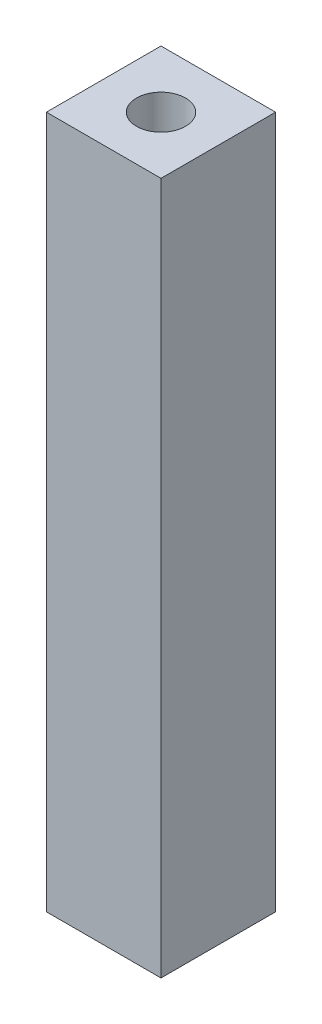
ISO-10303-21;
HEADER;
FILE_DESCRIPTION(('STEP AP214'),'2;1');
FILE_NAME('part.step','',(''),(''),'','','');
FILE_SCHEMA(('AUTOMOTIVE_DESIGN { 1 0 10303 214 1 1 1 1 }'));
ENDSEC;
DATA;
#1=APPLICATION_CONTEXT('core data for automotive mechanical design processes');
#2=APPLICATION_PROTOCOL_DEFINITION('international standard','automotive_design',2000,#1);
#3=PRODUCT_CONTEXT('',#1,'mechanical');
#4=PRODUCT('Part','Part','',(#3));
#5=PRODUCT_RELATED_PRODUCT_CATEGORY('part','',(#4));
#6=PRODUCT_DEFINITION_FORMATION('','',#4);
#7=PRODUCT_DEFINITION_CONTEXT('part definition',#1,'design');
#8=PRODUCT_DEFINITION('design','',#6,#7);
#9=PRODUCT_DEFINITION_SHAPE('','',#8);
#10=(LENGTH_UNIT() NAMED_UNIT(*) SI_UNIT(.MILLI.,.METRE.));
#11=(NAMED_UNIT(*) PLANE_ANGLE_UNIT() SI_UNIT($,.RADIAN.));
#12=(NAMED_UNIT(*) SI_UNIT($,.STERADIAN.) SOLID_ANGLE_UNIT());
#13=UNCERTAINTY_MEASURE_WITH_UNIT(LENGTH_MEASURE(1.E-05),#10,'distance_accuracy_value','');
#14=(GEOMETRIC_REPRESENTATION_CONTEXT(3) GLOBAL_UNCERTAINTY_ASSIGNED_CONTEXT((#13)) GLOBAL_UNIT_ASSIGNED_CONTEXT((#10,
#11,#12)) REPRESENTATION_CONTEXT('',''));
#15=CARTESIAN_POINT('',(0.,0.,0.));
#16=DIRECTION('',(0.,0.,1.));
#17=DIRECTION('',(1.,0.,0.));
#18=AXIS2_PLACEMENT_3D('',#15,#16,#17);
#19=CARTESIAN_POINT('',(0.,55.,0.));
#20=DIRECTION('',(1.,0.,0.));
#21=DIRECTION('',(0.,0.,-1.));
#22=AXIS2_PLACEMENT_3D('',#19,#20,#21);
#23=PLANE('',#22);
#24=DIRECTION('',(0.,0.,1.));
#25=VECTOR('',#24,1.);
#26=CARTESIAN_POINT('',(0.,0.,0.));
#27=LINE('',#26,#25);
#28=CARTESIAN_POINT('',(0.,0.,-9.1));
#29=VERTEX_POINT('',#28);
#30=CARTESIAN_POINT('',(0.,0.,0.));
#31=VERTEX_POINT('',#30);
#32=EDGE_CURVE('E107',#29,#31,#27,.T.);
#33=ORIENTED_EDGE('',*,*,#32,.T.);
#34=DIRECTION('',(0.,-1.,0.));
#35=VECTOR('',#34,1.);
#36=CARTESIAN_POINT('',(0.,55.,0.));
#37=LINE('',#36,#35);
#38=CARTESIAN_POINT('',(0.,55.,0.));
#39=VERTEX_POINT('',#38);
#40=EDGE_CURVE('E13',#39,#31,#37,.T.);
#41=ORIENTED_EDGE('',*,*,#40,.F.);
#42=DIRECTION('',(0.,0.,1.));
#43=VECTOR('',#42,1.);
#44=CARTESIAN_POINT('',(0.,55.,0.));
#45=LINE('',#44,#43);
#46=CARTESIAN_POINT('',(0.,55.,-9.1));
#47=VERTEX_POINT('',#46);
#48=EDGE_CURVE('E95',#47,#39,#45,.T.);
#49=ORIENTED_EDGE('',*,*,#48,.F.);
#50=DIRECTION('',(0.,-1.,0.));
#51=VECTOR('',#50,1.);
#52=CARTESIAN_POINT('',(0.,55.,-9.1));
#53=LINE('',#52,#51);
#54=EDGE_CURVE('E103',#47,#29,#53,.T.);
#55=ORIENTED_EDGE('',*,*,#54,.T.);
#56=EDGE_LOOP('',(#33,#41,#49,#55));
#57=FACE_BOUND('',#56,.T.);
#58=ADVANCED_FACE('F44',(#57),#23,.F.);
#59=CARTESIAN_POINT('',(0.,55.,0.));
#60=DIRECTION('',(0.,0.,-1.));
#61=DIRECTION('',(-1.,0.,0.));
#62=AXIS2_PLACEMENT_3D('',#59,#60,#61);
#63=PLANE('',#62);
#64=DIRECTION('',(1.,0.,0.));
#65=VECTOR('',#64,1.);
#66=CARTESIAN_POINT('',(0.,0.,0.));
#67=LINE('',#66,#65);
#68=CARTESIAN_POINT('',(9.1,0.,0.));
#69=VERTEX_POINT('',#68);
#70=EDGE_CURVE('E99',#31,#69,#67,.T.);
#71=ORIENTED_EDGE('',*,*,#70,.T.);
#72=DIRECTION('',(0.,-1.,0.));
#73=VECTOR('',#72,1.);
#74=CARTESIAN_POINT('',(9.1,55.,0.));
#75=LINE('',#74,#73);
#76=CARTESIAN_POINT('',(9.1,55.,0.));
#77=VERTEX_POINT('',#76);
#78=EDGE_CURVE('E52',#77,#69,#75,.T.);
#79=ORIENTED_EDGE('',*,*,#78,.F.);
#80=DIRECTION('',(1.,0.,0.));
#81=VECTOR('',#80,1.);
#82=CARTESIAN_POINT('',(0.,55.,0.));
#83=LINE('',#82,#81);
#84=EDGE_CURVE('E90',#39,#77,#83,.T.);
#85=ORIENTED_EDGE('',*,*,#84,.F.);
#86=ORIENTED_EDGE('',*,*,#40,.T.);
#87=EDGE_LOOP('',(#71,#79,#85,#86));
#88=FACE_BOUND('',#87,.T.);
#89=ADVANCED_FACE('F98',(#88),#63,.F.);
#90=CARTESIAN_POINT('',(9.1,55.,0.));
#91=DIRECTION('',(-1.,0.,0.));
#92=DIRECTION('',(0.,0.,1.));
#93=AXIS2_PLACEMENT_3D('',#90,#91,#92);
#94=PLANE('',#93);
#95=DIRECTION('',(0.,0.,-1.));
#96=VECTOR('',#95,1.);
#97=CARTESIAN_POINT('',(9.1,0.,0.));
#98=LINE('',#97,#96);
#99=CARTESIAN_POINT('',(9.1,0.,-9.1));
#100=VERTEX_POINT('',#99);
#101=EDGE_CURVE('E77',#69,#100,#98,.T.);
#102=ORIENTED_EDGE('',*,*,#101,.T.);
#103=DIRECTION('',(0.,-1.,0.));
#104=VECTOR('',#103,1.);
#105=CARTESIAN_POINT('',(9.1,55.,-9.1));
#106=LINE('',#105,#104);
#107=CARTESIAN_POINT('',(9.1,55.,-9.1));
#108=VERTEX_POINT('',#107);
#109=EDGE_CURVE('E100',#108,#100,#106,.T.);
#110=ORIENTED_EDGE('',*,*,#109,.F.);
#111=DIRECTION('',(0.,0.,-1.));
#112=VECTOR('',#111,1.);
#113=CARTESIAN_POINT('',(9.1,55.,0.));
#114=LINE('',#113,#112);
#115=EDGE_CURVE('E93',#77,#108,#114,.T.);
#116=ORIENTED_EDGE('',*,*,#115,.F.);
#117=ORIENTED_EDGE('',*,*,#78,.T.);
#118=EDGE_LOOP('',(#102,#110,#116,#117));
#119=FACE_BOUND('',#118,.T.);
#120=ADVANCED_FACE('F101',(#119),#94,.F.);
#121=CARTESIAN_POINT('',(0.,55.,-9.1));
#122=DIRECTION('',(0.,0.,1.));
#123=DIRECTION('',(1.,0.,0.));
#124=AXIS2_PLACEMENT_3D('',#121,#122,#123);
#125=PLANE('',#124);
#126=DIRECTION('',(-1.,0.,0.));
#127=VECTOR('',#126,1.);
#128=CARTESIAN_POINT('',(0.,0.,-9.1));
#129=LINE('',#128,#127);
#130=EDGE_CURVE('E83',#100,#29,#129,.T.);
#131=ORIENTED_EDGE('',*,*,#130,.T.);
#132=ORIENTED_EDGE('',*,*,#54,.F.);
#133=DIRECTION('',(-1.,0.,0.));
#134=VECTOR('',#133,1.);
#135=CARTESIAN_POINT('',(0.,55.,-9.1));
#136=LINE('',#135,#134);
#137=EDGE_CURVE('E60',#108,#47,#136,.T.);
#138=ORIENTED_EDGE('',*,*,#137,.F.);
#139=ORIENTED_EDGE('',*,*,#109,.T.);
#140=EDGE_LOOP('',(#131,#132,#138,#139));
#141=FACE_BOUND('',#140,.T.);
#142=ADVANCED_FACE('F115',(#141),#125,.F.);
#143=CARTESIAN_POINT('',(0.,55.,0.));
#144=DIRECTION('',(0.,-1.,0.));
#145=DIRECTION('',(0.,0.,-1.));
#146=AXIS2_PLACEMENT_3D('',#143,#144,#145);
#147=PLANE('',#146);
#148=CARTESIAN_POINT('',(4.55000000000011,55.,-4.54999999999995));
#149=DIRECTION('',(0.,1.,0.));
#150=DIRECTION('',(0.,0.,1.));
#151=AXIS2_PLACEMENT_3D('',#148,#149,#150);
#152=CIRCLE('',#151,1.95);
#153=CARTESIAN_POINT('',(4.55000000000011,55.,-2.59999999999995));
#154=VERTEX_POINT('',#153);
#155=EDGE_CURVE('E121',#154,#154,#152,.T.);
#156=ORIENTED_EDGE('',*,*,#155,.F.);
#157=EDGE_LOOP('',(#156));
#158=FACE_BOUND('',#157,.T.);
#159=ORIENTED_EDGE('',*,*,#48,.T.);
#160=ORIENTED_EDGE('',*,*,#84,.T.);
#161=ORIENTED_EDGE('',*,*,#115,.T.);
#162=ORIENTED_EDGE('',*,*,#137,.T.);
#163=EDGE_LOOP('',(#159,#160,#161,#162));
#164=FACE_BOUND('',#163,.T.);
#165=ADVANCED_FACE('F91',(#158,#164),#147,.F.);
#166=CARTESIAN_POINT('',(0.,0.,0.));
#167=DIRECTION('',(0.,-1.,0.));
#168=DIRECTION('',(0.,0.,-1.));
#169=AXIS2_PLACEMENT_3D('',#166,#167,#168);
#170=PLANE('',#169);
#171=CARTESIAN_POINT('',(4.55000000000011,0.,-4.55000000000005));
#172=DIRECTION('',(0.,-1.,0.));
#173=DIRECTION('',(0.,0.,-1.));
#174=AXIS2_PLACEMENT_3D('',#171,#172,#173);
#175=CIRCLE('',#174,1.95000000000001);
#176=CARTESIAN_POINT('',(4.55000000000011,0.,-6.50000000000006));
#177=VERTEX_POINT('',#176);
#178=EDGE_CURVE('E127',#177,#177,#175,.T.);
#179=ORIENTED_EDGE('',*,*,#178,.F.);
#180=EDGE_LOOP('',(#179));
#181=FACE_BOUND('',#180,.T.);
#182=ORIENTED_EDGE('',*,*,#32,.F.);
#183=ORIENTED_EDGE('',*,*,#130,.F.);
#184=ORIENTED_EDGE('',*,*,#101,.F.);
#185=ORIENTED_EDGE('',*,*,#70,.F.);
#186=EDGE_LOOP('',(#182,#183,#184,#185));
#187=FACE_BOUND('',#186,.T.);
#188=ADVANCED_FACE('F118',(#181,#187),#170,.T.);
#189=CARTESIAN_POINT('',(4.55000000000011,42.,-4.54999999999995));
#190=DIRECTION('',(0.,1.,0.));
#191=DIRECTION('',(0.,0.,1.));
#192=AXIS2_PLACEMENT_3D('',#189,#190,#191);
#193=CYLINDRICAL_SURFACE('',#192,1.95);
#194=CARTESIAN_POINT('',(4.55000000000011,42.,-4.54999999999995));
#195=DIRECTION('',(0.,1.,0.));
#196=DIRECTION('',(0.,0.,1.));
#197=AXIS2_PLACEMENT_3D('',#194,#195,#196);
#198=CIRCLE('',#197,1.95);
#199=CARTESIAN_POINT('',(4.55000000000011,42.,-2.59999999999995));
#200=VERTEX_POINT('',#199);
#201=EDGE_CURVE('E110',#200,#200,#198,.T.);
#202=ORIENTED_EDGE('',*,*,#201,.F.);
#203=EDGE_LOOP('',(#202));
#204=FACE_BOUND('',#203,.T.);
#205=ORIENTED_EDGE('',*,*,#155,.T.);
#206=EDGE_LOOP('',(#205));
#207=FACE_BOUND('',#206,.T.);
#208=ADVANCED_FACE('F143',(#204,#207),#193,.F.);
#209=CARTESIAN_POINT('',(4.55000000000011,42.,-4.54999999999995));
#210=DIRECTION('',(0.,1.,0.));
#211=DIRECTION('',(0.,0.,1.));
#212=AXIS2_PLACEMENT_3D('',#209,#210,#211);
#213=PLANE('',#212);
#214=ORIENTED_EDGE('',*,*,#201,.T.);
#215=EDGE_LOOP('',(#214));
#216=FACE_BOUND('',#215,.T.);
#217=ADVANCED_FACE('F138',(#216),#213,.T.);
#218=CARTESIAN_POINT('',(4.55000000000011,10.,-4.55000000000005));
#219=DIRECTION('',(0.,-1.,0.));
#220=DIRECTION('',(0.,0.,-1.));
#221=AXIS2_PLACEMENT_3D('',#218,#219,#220);
#222=CYLINDRICAL_SURFACE('',#221,1.95000000000001);
#223=CARTESIAN_POINT('',(4.55000000000011,10.,-4.55000000000005));
#224=DIRECTION('',(0.,-1.,0.));
#225=DIRECTION('',(0.,0.,-1.));
#226=AXIS2_PLACEMENT_3D('',#223,#224,#225);
#227=CIRCLE('',#226,1.95000000000001);
#228=CARTESIAN_POINT('',(4.55000000000011,10.,-6.50000000000006));
#229=VERTEX_POINT('',#228);
#230=EDGE_CURVE('E124',#229,#229,#227,.T.);
#231=ORIENTED_EDGE('',*,*,#230,.F.);
#232=EDGE_LOOP('',(#231));
#233=FACE_BOUND('',#232,.T.);
#234=ORIENTED_EDGE('',*,*,#178,.T.);
#235=EDGE_LOOP('',(#234));
#236=FACE_BOUND('',#235,.T.);
#237=ADVANCED_FACE('F135',(#233,#236),#222,.F.);
#238=CARTESIAN_POINT('',(4.55000000000011,10.,-4.55000000000005));
#239=DIRECTION('',(0.,-1.,0.));
#240=DIRECTION('',(0.,0.,-1.));
#241=AXIS2_PLACEMENT_3D('',#238,#239,#240);
#242=PLANE('',#241);
#243=ORIENTED_EDGE('',*,*,#230,.T.);
#244=EDGE_LOOP('',(#243));
#245=FACE_BOUND('',#244,.T.);
#246=ADVANCED_FACE('F133',(#245),#242,.T.);
#247=CLOSED_SHELL('',(#58,#89,#120,#142,#165,#188,#208,#217,#237,#246));
#248=MANIFOLD_SOLID_BREP('B2',#247);
#249=ADVANCED_BREP_SHAPE_REPRESENTATION('',(#18,#248),#14);
#250=SHAPE_DEFINITION_REPRESENTATION(#9,#249);
ENDSEC;
END-ISO-10303-21;
